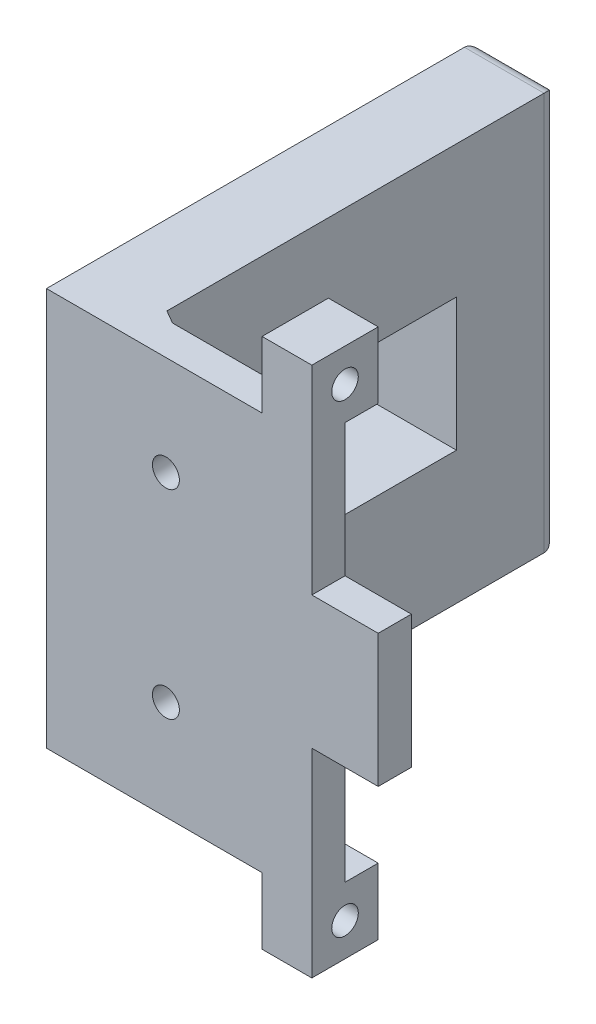
ISO-10303-21;
HEADER;
FILE_DESCRIPTION(('STEP AP214'),'2;1');
FILE_NAME('part.step','',(''),(''),'','','');
FILE_SCHEMA(('AUTOMOTIVE_DESIGN { 1 0 10303 214 1 1 1 1 }'));
ENDSEC;
DATA;
#1=APPLICATION_CONTEXT('core data for automotive mechanical design processes');
#2=APPLICATION_PROTOCOL_DEFINITION('international standard','automotive_design',2000,#1);
#3=PRODUCT_CONTEXT('',#1,'mechanical');
#4=PRODUCT('Part','Part','',(#3));
#5=PRODUCT_RELATED_PRODUCT_CATEGORY('part','',(#4));
#6=PRODUCT_DEFINITION_FORMATION('','',#4);
#7=PRODUCT_DEFINITION_CONTEXT('part definition',#1,'design');
#8=PRODUCT_DEFINITION('design','',#6,#7);
#9=PRODUCT_DEFINITION_SHAPE('','',#8);
#10=(LENGTH_UNIT() NAMED_UNIT(*) SI_UNIT(.MILLI.,.METRE.));
#11=(NAMED_UNIT(*) PLANE_ANGLE_UNIT() SI_UNIT($,.RADIAN.));
#12=(NAMED_UNIT(*) SI_UNIT($,.STERADIAN.) SOLID_ANGLE_UNIT());
#13=UNCERTAINTY_MEASURE_WITH_UNIT(LENGTH_MEASURE(1.E-05),#10,'distance_accuracy_value','');
#14=(GEOMETRIC_REPRESENTATION_CONTEXT(3) GLOBAL_UNCERTAINTY_ASSIGNED_CONTEXT((#13)) GLOBAL_UNIT_ASSIGNED_CONTEXT((#10,
#11,#12)) REPRESENTATION_CONTEXT('',''));
#15=CARTESIAN_POINT('',(0.,0.,0.));
#16=DIRECTION('',(0.,0.,1.));
#17=DIRECTION('',(1.,0.,0.));
#18=AXIS2_PLACEMENT_3D('',#15,#16,#17);
#19=CARTESIAN_POINT('',(-50.8000000000001,50.8000000000002,-76.21));
#20=DIRECTION('',(0.,-1.,0.));
#21=DIRECTION('',(1.,0.,0.));
#22=AXIS2_PLACEMENT_3D('',#19,#20,#21);
#23=PLANE('',#22);
#24=DIRECTION('',(-1.,0.,0.));
#25=VECTOR('',#24,1.);
#26=CARTESIAN_POINT('',(8.32667268468854E-13,50.7999999999994,0.));
#27=LINE('',#26,#25);
#28=CARTESIAN_POINT('',(-38.1000000000001,50.8,0.));
#29=VERTEX_POINT('',#28);
#30=CARTESIAN_POINT('',(-50.8000000000001,50.8000000000002,0.));
#31=VERTEX_POINT('',#30);
#32=EDGE_CURVE('E400',#29,#31,#27,.T.);
#33=ORIENTED_EDGE('',*,*,#32,.T.);
#34=DIRECTION('',(0.,0.,1.));
#35=VECTOR('',#34,1.);
#36=CARTESIAN_POINT('',(-50.8000000000001,50.8000000000002,-76.21));
#37=LINE('',#36,#35);
#38=CARTESIAN_POINT('',(-50.8000000000001,50.8000000000002,6.35));
#39=VERTEX_POINT('',#38);
#40=EDGE_CURVE('E11',#31,#39,#37,.T.);
#41=ORIENTED_EDGE('',*,*,#40,.T.);
#42=DIRECTION('',(-1.,0.,0.));
#43=VECTOR('',#42,1.);
#44=CARTESIAN_POINT('',(8.32667268468854E-13,50.7999999999994,6.35));
#45=LINE('',#44,#43);
#46=CARTESIAN_POINT('',(-38.1000000000001,50.8,6.35));
#47=VERTEX_POINT('',#46);
#48=EDGE_CURVE('E371',#47,#39,#45,.T.);
#49=ORIENTED_EDGE('',*,*,#48,.F.);
#50=DIRECTION('',(0.,0.,1.));
#51=VECTOR('',#50,1.);
#52=CARTESIAN_POINT('',(-38.1000000000001,50.8,-76.21));
#53=LINE('',#52,#51);
#54=EDGE_CURVE('E42',#29,#47,#53,.T.);
#55=ORIENTED_EDGE('',*,*,#54,.F.);
#56=EDGE_LOOP('',(#33,#41,#49,#55));
#57=FACE_BOUND('',#56,.T.);
#58=ADVANCED_FACE('F33',(#57),#23,.F.);
#59=CARTESIAN_POINT('',(-38.1000000000001,25.4,-76.21));
#60=DIRECTION('',(-1.,0.,0.));
#61=DIRECTION('',(0.,0.,1.));
#62=AXIS2_PLACEMENT_3D('',#59,#60,#61);
#63=PLANE('',#62);
#64=DIRECTION('',(0.,1.,0.));
#65=VECTOR('',#64,1.);
#66=CARTESIAN_POINT('',(-38.1000000000001,0.,0.));
#67=LINE('',#66,#65);
#68=CARTESIAN_POINT('',(-38.1000000000001,25.4,0.));
#69=VERTEX_POINT('',#68);
#70=EDGE_CURVE('E401',#69,#29,#67,.T.);
#71=ORIENTED_EDGE('',*,*,#70,.T.);
#72=ORIENTED_EDGE('',*,*,#54,.T.);
#73=DIRECTION('',(0.,1.,0.));
#74=VECTOR('',#73,1.);
#75=CARTESIAN_POINT('',(-38.1000000000001,0.,6.35));
#76=LINE('',#75,#74);
#77=CARTESIAN_POINT('',(-38.1000000000001,25.4,6.35));
#78=VERTEX_POINT('',#77);
#79=EDGE_CURVE('E374',#78,#47,#76,.T.);
#80=ORIENTED_EDGE('',*,*,#79,.F.);
#81=DIRECTION('',(0.,0.,1.));
#82=VECTOR('',#81,1.);
#83=CARTESIAN_POINT('',(-38.1000000000001,25.4,-76.21));
#84=LINE('',#83,#82);
#85=EDGE_CURVE('E386',#69,#78,#84,.T.);
#86=ORIENTED_EDGE('',*,*,#85,.F.);
#87=EDGE_LOOP('',(#71,#72,#80,#86));
#88=FACE_BOUND('',#87,.T.);
#89=ADVANCED_FACE('F416',(#88),#63,.F.);
#90=CARTESIAN_POINT('',(-50.8000000000001,25.4,-76.21));
#91=DIRECTION('',(0.,1.,0.));
#92=DIRECTION('',(0.,0.,1.));
#93=AXIS2_PLACEMENT_3D('',#90,#91,#92);
#94=PLANE('',#93);
#95=DIRECTION('',(1.,0.,0.));
#96=VECTOR('',#95,1.);
#97=CARTESIAN_POINT('',(0.,25.4,0.));
#98=LINE('',#97,#96);
#99=CARTESIAN_POINT('',(-50.8000000000001,25.4,0.));
#100=VERTEX_POINT('',#99);
#101=EDGE_CURVE('E37',#100,#69,#98,.T.);
#102=ORIENTED_EDGE('',*,*,#101,.T.);
#103=ORIENTED_EDGE('',*,*,#85,.T.);
#104=DIRECTION('',(1.,0.,0.));
#105=VECTOR('',#104,1.);
#106=CARTESIAN_POINT('',(0.,25.4,6.35));
#107=LINE('',#106,#105);
#108=CARTESIAN_POINT('',(-50.8000000000001,25.4,6.35));
#109=VERTEX_POINT('',#108);
#110=EDGE_CURVE('E377',#109,#78,#107,.T.);
#111=ORIENTED_EDGE('',*,*,#110,.F.);
#112=DIRECTION('',(0.,0.,1.));
#113=VECTOR('',#112,1.);
#114=CARTESIAN_POINT('',(-50.8000000000001,25.4,-76.21));
#115=LINE('',#114,#113);
#116=EDGE_CURVE('E360',#100,#109,#115,.T.);
#117=ORIENTED_EDGE('',*,*,#116,.F.);
#118=EDGE_LOOP('',(#102,#103,#111,#117));
#119=FACE_BOUND('',#118,.T.);
#120=ADVANCED_FACE('F408',(#119),#94,.F.);
#121=CARTESIAN_POINT('',(-50.8000000000001,-12.7,-76.21));
#122=DIRECTION('',(-1.,0.,0.));
#123=DIRECTION('',(0.,0.,1.));
#124=AXIS2_PLACEMENT_3D('',#121,#122,#123);
#125=PLANE('',#124);
#126=DIRECTION('',(0.,1.,0.));
#127=VECTOR('',#126,1.);
#128=CARTESIAN_POINT('',(-50.8000000000001,0.,0.));
#129=LINE('',#128,#127);
#130=CARTESIAN_POINT('',(-50.8000000000001,0.,0.));
#131=VERTEX_POINT('',#130);
#132=EDGE_CURVE('E382',#131,#100,#129,.T.);
#133=ORIENTED_EDGE('',*,*,#132,.T.);
#134=ORIENTED_EDGE('',*,*,#116,.T.);
#135=DIRECTION('',(0.,1.,0.));
#136=VECTOR('',#135,1.);
#137=CARTESIAN_POINT('',(-50.8000000000001,0.,6.35));
#138=LINE('',#137,#136);
#139=CARTESIAN_POINT('',(-50.8000000000001,-12.7,6.35));
#140=VERTEX_POINT('',#139);
#141=EDGE_CURVE('E380',#140,#109,#138,.T.);
#142=ORIENTED_EDGE('',*,*,#141,.F.);
#143=DIRECTION('',(0.,0.,-1.));
#144=VECTOR('',#143,1.);
#145=CARTESIAN_POINT('',(-50.8000000000001,-12.7,0.));
#146=LINE('',#145,#144);
#147=CARTESIAN_POINT('',(-50.8000000000001,-12.7,-6.34999999999999));
#148=VERTEX_POINT('',#147);
#149=EDGE_CURVE('E57',#140,#148,#146,.T.);
#150=ORIENTED_EDGE('',*,*,#149,.T.);
#151=DIRECTION('',(0.,1.,0.));
#152=VECTOR('',#151,1.);
#153=CARTESIAN_POINT('',(-50.8000000000001,-12.7,-6.34999999999999));
#154=LINE('',#153,#152);
#155=CARTESIAN_POINT('',(-50.8000000000001,0.,-6.34999999999999));
#156=VERTEX_POINT('',#155);
#157=EDGE_CURVE('E50',#148,#156,#154,.T.);
#158=ORIENTED_EDGE('',*,*,#157,.T.);
#159=DIRECTION('',(0.,0.,-1.));
#160=VECTOR('',#159,1.);
#161=CARTESIAN_POINT('',(-50.8000000000001,0.,0.));
#162=LINE('',#161,#160);
#163=EDGE_CURVE('E363',#131,#156,#162,.T.);
#164=ORIENTED_EDGE('',*,*,#163,.F.);
#165=EDGE_LOOP('',(#133,#134,#142,#150,#158,#164));
#166=FACE_BOUND('',#165,.T.);
#167=CARTESIAN_POINT('',(-50.8000000000001,-6.35000000000001,0.));
#168=DIRECTION('',(-1.,0.,0.));
#169=DIRECTION('',(0.,0.,1.));
#170=AXIS2_PLACEMENT_3D('',#167,#168,#169);
#171=CIRCLE('',#170,2.54);
#172=CARTESIAN_POINT('',(-50.8000000000001,-6.35000000000001,2.54));
#173=VERTEX_POINT('',#172);
#174=EDGE_CURVE('E357',#173,#173,#171,.T.);
#175=ORIENTED_EDGE('',*,*,#174,.T.);
#176=EDGE_LOOP('',(#175));
#177=FACE_BOUND('',#176,.T.);
#178=ADVANCED_FACE('F35',(#166,#177),#125,.F.);
#179=CARTESIAN_POINT('',(-50.8000000000003,88.9000000000002,-76.21));
#180=DIRECTION('',(-1.,0.,0.));
#181=DIRECTION('',(0.,-1.,0.));
#182=AXIS2_PLACEMENT_3D('',#179,#180,#181);
#183=PLANE('',#182);
#184=DIRECTION('',(0.,1.,0.));
#185=VECTOR('',#184,1.);
#186=CARTESIAN_POINT('',(-50.7999999999999,-2.40548322002117E-13,0.));
#187=LINE('',#186,#185);
#188=CARTESIAN_POINT('',(-50.8000000000003,76.2,0.));
#189=VERTEX_POINT('',#188);
#190=EDGE_CURVE('E368',#31,#189,#187,.T.);
#191=ORIENTED_EDGE('',*,*,#190,.T.);
#192=DIRECTION('',(0.,0.,1.));
#193=VECTOR('',#192,1.);
#194=CARTESIAN_POINT('',(-50.8000000000003,76.2,0.));
#195=LINE('',#194,#193);
#196=CARTESIAN_POINT('',(-50.8000000000003,76.2,-6.34999999999999));
#197=VERTEX_POINT('',#196);
#198=EDGE_CURVE('E392',#197,#189,#195,.T.);
#199=ORIENTED_EDGE('',*,*,#198,.F.);
#200=DIRECTION('',(0.,-1.,0.));
#201=VECTOR('',#200,1.);
#202=CARTESIAN_POINT('',(-50.8000000000003,88.9,-6.34999999999999));
#203=LINE('',#202,#201);
#204=CARTESIAN_POINT('',(-50.8000000000003,88.9,-6.34999999999999));
#205=VERTEX_POINT('',#204);
#206=EDGE_CURVE('E372',#205,#197,#203,.T.);
#207=ORIENTED_EDGE('',*,*,#206,.F.);
#208=DIRECTION('',(0.,0.,1.));
#209=VECTOR('',#208,1.);
#210=CARTESIAN_POINT('',(-50.8000000000003,88.9,0.));
#211=LINE('',#210,#209);
#212=CARTESIAN_POINT('',(-50.8000000000003,88.9,6.35));
#213=VERTEX_POINT('',#212);
#214=EDGE_CURVE('E365',#205,#213,#211,.T.);
#215=ORIENTED_EDGE('',*,*,#214,.T.);
#216=DIRECTION('',(0.,1.,0.));
#217=VECTOR('',#216,1.);
#218=CARTESIAN_POINT('',(-50.7999999999999,-2.40548322002117E-13,6.35));
#219=LINE('',#218,#217);
#220=EDGE_CURVE('E369',#39,#213,#219,.T.);
#221=ORIENTED_EDGE('',*,*,#220,.F.);
#222=ORIENTED_EDGE('',*,*,#40,.F.);
#223=EDGE_LOOP('',(#191,#199,#207,#215,#221,#222));
#224=FACE_BOUND('',#223,.T.);
#225=CARTESIAN_POINT('',(-50.8000000000003,82.55,0.));
#226=DIRECTION('',(-1.,0.,0.));
#227=DIRECTION('',(0.,-1.,0.));
#228=AXIS2_PLACEMENT_3D('',#225,#226,#227);
#229=CIRCLE('',#228,2.54);
#230=CARTESIAN_POINT('',(-50.8000000000003,80.01,0.));
#231=VERTEX_POINT('',#230);
#232=EDGE_CURVE('E348',#231,#231,#229,.F.);
#233=ORIENTED_EDGE('',*,*,#232,.F.);
#234=EDGE_LOOP('',(#233));
#235=FACE_BOUND('',#234,.T.);
#236=ADVANCED_FACE('F457',(#224,#235),#183,.F.);
#237=CARTESIAN_POINT('',(-101.6,0.,6.35));
#238=DIRECTION('',(0.,1.,0.));
#239=DIRECTION('',(0.,0.,1.));
#240=AXIS2_PLACEMENT_3D('',#237,#238,#239);
#241=PLANE('',#240);
#242=DIRECTION('',(1.,0.,0.));
#243=VECTOR('',#242,1.);
#244=CARTESIAN_POINT('',(-101.6,0.,0.));
#245=LINE('',#244,#243);
#246=CARTESIAN_POINT('',(-83.8200000000001,0.,0.));
#247=VERTEX_POINT('',#246);
#248=CARTESIAN_POINT('',(-60.325,0.,0.));
#249=VERTEX_POINT('',#248);
#250=EDGE_CURVE('E301',#247,#249,#245,.T.);
#251=ORIENTED_EDGE('',*,*,#250,.T.);
#252=DIRECTION('',(0.,0.,1.));
#253=VECTOR('',#252,1.);
#254=CARTESIAN_POINT('',(-60.325,0.,6.35));
#255=LINE('',#254,#253);
#256=CARTESIAN_POINT('',(-60.325,0.,6.35));
#257=VERTEX_POINT('',#256);
#258=EDGE_CURVE('E224',#249,#257,#255,.T.);
#259=ORIENTED_EDGE('',*,*,#258,.T.);
#260=DIRECTION('',(1.,0.,0.));
#261=VECTOR('',#260,1.);
#262=CARTESIAN_POINT('',(-101.6,0.,6.35));
#263=LINE('',#262,#261);
#264=CARTESIAN_POINT('',(-101.6,0.,6.35));
#265=VERTEX_POINT('',#264);
#266=EDGE_CURVE('E302',#265,#257,#263,.T.);
#267=ORIENTED_EDGE('',*,*,#266,.F.);
#268=DIRECTION('',(0.,0.,-1.));
#269=VECTOR('',#268,1.);
#270=CARTESIAN_POINT('',(-101.6,0.,6.35));
#271=LINE('',#270,#269);
#272=CARTESIAN_POINT('',(-101.6,0.,-73.66));
#273=VERTEX_POINT('',#272);
#274=EDGE_CURVE('E310',#265,#273,#271,.T.);
#275=ORIENTED_EDGE('',*,*,#274,.T.);
#276=DIRECTION('',(-1.,0.,0.));
#277=VECTOR('',#276,1.);
#278=CARTESIAN_POINT('',(-86.3600000000001,0.,-73.66));
#279=LINE('',#278,#277);
#280=CARTESIAN_POINT('',(-86.3600000000001,0.,-73.66));
#281=VERTEX_POINT('',#280);
#282=EDGE_CURVE('E339',#273,#281,#279,.F.);
#283=ORIENTED_EDGE('',*,*,#282,.T.);
#284=DIRECTION('',(0.,0.,1.));
#285=VECTOR('',#284,1.);
#286=CARTESIAN_POINT('',(-86.3600000000001,0.,-76.2));
#287=LINE('',#286,#285);
#288=CARTESIAN_POINT('',(-86.3600000000001,0.,-1.4664696837417));
#289=VERTEX_POINT('',#288);
#290=EDGE_CURVE('E284',#281,#289,#287,.T.);
#291=ORIENTED_EDGE('',*,*,#290,.T.);
#292=DIRECTION('',(0.866025403784437,0.,0.500000000000004));
#293=VECTOR('',#292,1.);
#294=CARTESIAN_POINT('',(-94.4053693429845,0.,-6.11146583964369));
#295=LINE('',#294,#293);
#296=EDGE_CURVE('E325',#289,#247,#295,.T.);
#297=ORIENTED_EDGE('',*,*,#296,.T.);
#298=EDGE_LOOP('',(#251,#259,#267,#275,#283,#291,#297));
#299=FACE_BOUND('',#298,.T.);
#300=ADVANCED_FACE('F466',(#299),#241,.F.);
#301=CARTESIAN_POINT('',(-101.6,76.2,6.35));
#302=DIRECTION('',(0.,1.,0.));
#303=DIRECTION('',(-1.,0.,0.));
#304=AXIS2_PLACEMENT_3D('',#301,#302,#303);
#305=PLANE('',#304);
#306=DIRECTION('',(1.,0.,0.));
#307=VECTOR('',#306,1.);
#308=CARTESIAN_POINT('',(-101.6,76.2,6.35));
#309=LINE('',#308,#307);
#310=CARTESIAN_POINT('',(-101.6,76.2,6.35));
#311=VERTEX_POINT('',#310);
#312=CARTESIAN_POINT('',(-60.325,76.2,6.35));
#313=VERTEX_POINT('',#312);
#314=EDGE_CURVE('E305',#311,#313,#309,.T.);
#315=ORIENTED_EDGE('',*,*,#314,.T.);
#316=DIRECTION('',(0.,0.,1.));
#317=VECTOR('',#316,1.);
#318=CARTESIAN_POINT('',(-60.325,76.2,6.35));
#319=LINE('',#318,#317);
#320=CARTESIAN_POINT('',(-60.325,76.2,0.));
#321=VERTEX_POINT('',#320);
#322=EDGE_CURVE('E228',#321,#313,#319,.T.);
#323=ORIENTED_EDGE('',*,*,#322,.F.);
#324=DIRECTION('',(1.,0.,0.));
#325=VECTOR('',#324,1.);
#326=CARTESIAN_POINT('',(-101.6,76.2,0.));
#327=LINE('',#326,#325);
#328=CARTESIAN_POINT('',(-83.8200000000001,76.2,0.));
#329=VERTEX_POINT('',#328);
#330=EDGE_CURVE('E306',#329,#321,#327,.T.);
#331=ORIENTED_EDGE('',*,*,#330,.F.);
#332=DIRECTION('',(-0.866025403784437,0.,-0.500000000000004));
#333=VECTOR('',#332,1.);
#334=CARTESIAN_POINT('',(-86.3600000000001,76.2,-1.46646968374167));
#335=LINE('',#334,#333);
#336=CARTESIAN_POINT('',(-86.3600000000001,76.2,-1.4664696837417));
#337=VERTEX_POINT('',#336);
#338=EDGE_CURVE('E327',#329,#337,#335,.T.);
#339=ORIENTED_EDGE('',*,*,#338,.T.);
#340=DIRECTION('',(0.,0.,1.));
#341=VECTOR('',#340,1.);
#342=CARTESIAN_POINT('',(-86.3600000000001,76.2,-76.2));
#343=LINE('',#342,#341);
#344=CARTESIAN_POINT('',(-86.3600000000001,76.2,-73.66));
#345=VERTEX_POINT('',#344);
#346=EDGE_CURVE('E286',#345,#337,#343,.T.);
#347=ORIENTED_EDGE('',*,*,#346,.F.);
#348=DIRECTION('',(1.,0.,0.));
#349=VECTOR('',#348,1.);
#350=CARTESIAN_POINT('',(-101.6,76.2,-73.66));
#351=LINE('',#350,#349);
#352=CARTESIAN_POINT('',(-101.6,76.2,-73.66));
#353=VERTEX_POINT('',#352);
#354=EDGE_CURVE('E346',#345,#353,#351,.F.);
#355=ORIENTED_EDGE('',*,*,#354,.T.);
#356=DIRECTION('',(0.,0.,-1.));
#357=VECTOR('',#356,1.);
#358=CARTESIAN_POINT('',(-101.6,76.2,6.35));
#359=LINE('',#358,#357);
#360=EDGE_CURVE('E317',#311,#353,#359,.T.);
#361=ORIENTED_EDGE('',*,*,#360,.F.);
#362=EDGE_LOOP('',(#315,#323,#331,#339,#347,#355,#361));
#363=FACE_BOUND('',#362,.T.);
#364=ADVANCED_FACE('F471',(#363),#305,.T.);
#365=CARTESIAN_POINT('',(-101.6,76.2,6.35));
#366=DIRECTION('',(1.,0.,0.));
#367=DIRECTION('',(0.,1.,0.));
#368=AXIS2_PLACEMENT_3D('',#365,#366,#367);
#369=PLANE('',#368);
#370=ORIENTED_EDGE('',*,*,#360,.T.);
#371=DIRECTION('',(0.,1.,0.));
#372=VECTOR('',#371,1.);
#373=CARTESIAN_POINT('',(-101.6,0.,-73.66));
#374=LINE('',#373,#372);
#375=EDGE_CURVE('E344',#353,#273,#374,.F.);
#376=ORIENTED_EDGE('',*,*,#375,.T.);
#377=ORIENTED_EDGE('',*,*,#274,.F.);
#378=DIRECTION('',(0.,-1.,0.));
#379=VECTOR('',#378,1.);
#380=CARTESIAN_POINT('',(-101.6,76.2,6.35));
#381=LINE('',#380,#379);
#382=EDGE_CURVE('E308',#311,#265,#381,.T.);
#383=ORIENTED_EDGE('',*,*,#382,.F.);
#384=EDGE_LOOP('',(#370,#376,#377,#383));
#385=FACE_BOUND('',#384,.T.);
#386=DIRECTION('',(0.,0.,-1.));
#387=VECTOR('',#386,1.);
#388=CARTESIAN_POINT('',(-101.6,25.4,-16.764));
#389=LINE('',#388,#387);
#390=CARTESIAN_POINT('',(-101.6,25.4,-16.764));
#391=VERTEX_POINT('',#390);
#392=CARTESIAN_POINT('',(-101.6,25.4,-56.896));
#393=VERTEX_POINT('',#392);
#394=EDGE_CURVE('E259',#391,#393,#389,.T.);
#395=ORIENTED_EDGE('',*,*,#394,.T.);
#396=DIRECTION('',(0.,-1.,0.));
#397=VECTOR('',#396,1.);
#398=CARTESIAN_POINT('',(-101.6,50.8,-56.896));
#399=LINE('',#398,#397);
#400=CARTESIAN_POINT('',(-101.6,50.8,-56.896));
#401=VERTEX_POINT('',#400);
#402=EDGE_CURVE('E270',#401,#393,#399,.T.);
#403=ORIENTED_EDGE('',*,*,#402,.F.);
#404=DIRECTION('',(0.,0.,-1.));
#405=VECTOR('',#404,1.);
#406=CARTESIAN_POINT('',(-101.6,50.8,-16.764));
#407=LINE('',#406,#405);
#408=CARTESIAN_POINT('',(-101.6,50.8,-16.764));
#409=VERTEX_POINT('',#408);
#410=EDGE_CURVE('E267',#409,#401,#407,.T.);
#411=ORIENTED_EDGE('',*,*,#410,.F.);
#412=DIRECTION('',(0.,-1.,0.));
#413=VECTOR('',#412,1.);
#414=CARTESIAN_POINT('',(-101.6,50.8,-16.764));
#415=LINE('',#414,#413);
#416=EDGE_CURVE('E264',#409,#391,#415,.T.);
#417=ORIENTED_EDGE('',*,*,#416,.T.);
#418=EDGE_LOOP('',(#395,#403,#411,#417));
#419=FACE_BOUND('',#418,.T.);
#420=ADVANCED_FACE('F734',(#385,#419),#369,.F.);
#421=CARTESIAN_POINT('',(-86.3600000000001,76.2,-76.2));
#422=DIRECTION('',(-1.,0.,0.));
#423=DIRECTION('',(0.,0.,1.));
#424=AXIS2_PLACEMENT_3D('',#421,#422,#423);
#425=PLANE('',#424);
#426=ORIENTED_EDGE('',*,*,#290,.F.);
#427=DIRECTION('',(0.,-1.,0.));
#428=VECTOR('',#427,1.);
#429=CARTESIAN_POINT('',(-86.3600000000001,76.2,-73.66));
#430=LINE('',#429,#428);
#431=EDGE_CURVE('E342',#281,#345,#430,.F.);
#432=ORIENTED_EDGE('',*,*,#431,.T.);
#433=ORIENTED_EDGE('',*,*,#346,.T.);
#434=DIRECTION('',(0.,-1.,0.));
#435=VECTOR('',#434,1.);
#436=CARTESIAN_POINT('',(-86.3600000000001,76.2,-1.46646968374167));
#437=LINE('',#436,#435);
#438=EDGE_CURVE('E320',#337,#289,#437,.T.);
#439=ORIENTED_EDGE('',*,*,#438,.T.);
#440=EDGE_LOOP('',(#426,#432,#433,#439));
#441=FACE_BOUND('',#440,.T.);
#442=DIRECTION('',(0.,0.,1.));
#443=VECTOR('',#442,1.);
#444=CARTESIAN_POINT('',(-86.3600000000001,25.4,-16.764));
#445=LINE('',#444,#443);
#446=CARTESIAN_POINT('',(-86.3600000000001,25.3999999999998,-56.896));
#447=VERTEX_POINT('',#446);
#448=CARTESIAN_POINT('',(-86.3600000000001,25.3999999999998,-16.764));
#449=VERTEX_POINT('',#448);
#450=EDGE_CURVE('E251',#447,#449,#445,.T.);
#451=ORIENTED_EDGE('',*,*,#450,.T.);
#452=DIRECTION('',(0.,1.,0.));
#453=VECTOR('',#452,1.);
#454=CARTESIAN_POINT('',(-86.3600000000001,50.7999999999998,-16.764));
#455=LINE('',#454,#453);
#456=CARTESIAN_POINT('',(-86.3600000000001,50.8,-16.764));
#457=VERTEX_POINT('',#456);
#458=EDGE_CURVE('E252',#449,#457,#455,.T.);
#459=ORIENTED_EDGE('',*,*,#458,.T.);
#460=DIRECTION('',(0.,0.,1.));
#461=VECTOR('',#460,1.);
#462=CARTESIAN_POINT('',(-86.3600000000001,50.8,-16.764));
#463=LINE('',#462,#461);
#464=CARTESIAN_POINT('',(-86.3600000000001,50.8,-56.896));
#465=VERTEX_POINT('',#464);
#466=EDGE_CURVE('E279',#465,#457,#463,.T.);
#467=ORIENTED_EDGE('',*,*,#466,.F.);
#468=DIRECTION('',(0.,1.,0.));
#469=VECTOR('',#468,1.);
#470=CARTESIAN_POINT('',(-86.3600000000001,50.7999999999998,-56.896));
#471=LINE('',#470,#469);
#472=EDGE_CURVE('E273',#447,#465,#471,.T.);
#473=ORIENTED_EDGE('',*,*,#472,.F.);
#474=EDGE_LOOP('',(#451,#459,#467,#473));
#475=FACE_BOUND('',#474,.T.);
#476=ADVANCED_FACE('F689',(#441,#475),#425,.F.);
#477=CARTESIAN_POINT('',(0.,0.,0.));
#478=DIRECTION('',(0.,0.,-1.));
#479=DIRECTION('',(-1.,0.,0.));
#480=AXIS2_PLACEMENT_3D('',#477,#478,#479);
#481=PLANE('',#480);
#482=ORIENTED_EDGE('',*,*,#132,.F.);
#483=DIRECTION('',(-1.,0.,0.));
#484=VECTOR('',#483,1.);
#485=CARTESIAN_POINT('',(0.,0.,0.));
#486=LINE('',#485,#484);
#487=EDGE_CURVE('E211',#131,#249,#486,.T.);
#488=ORIENTED_EDGE('',*,*,#487,.T.);
#489=ORIENTED_EDGE('',*,*,#250,.F.);
#490=DIRECTION('',(0.,1.,0.));
#491=VECTOR('',#490,1.);
#492=CARTESIAN_POINT('',(-83.8200000000001,0.,0.));
#493=LINE('',#492,#491);
#494=EDGE_CURVE('E323',#247,#329,#493,.T.);
#495=ORIENTED_EDGE('',*,*,#494,.T.);
#496=ORIENTED_EDGE('',*,*,#330,.T.);
#497=DIRECTION('',(1.,0.,0.));
#498=VECTOR('',#497,1.);
#499=CARTESIAN_POINT('',(0.,76.2,0.));
#500=LINE('',#499,#498);
#501=EDGE_CURVE('E248',#321,#189,#500,.T.);
#502=ORIENTED_EDGE('',*,*,#501,.T.);
#503=ORIENTED_EDGE('',*,*,#190,.F.);
#504=ORIENTED_EDGE('',*,*,#32,.F.);
#505=ORIENTED_EDGE('',*,*,#70,.F.);
#506=ORIENTED_EDGE('',*,*,#101,.F.);
#507=EDGE_LOOP('',(#482,#488,#489,#495,#496,#502,#503,#504,#505,#506));
#508=FACE_BOUND('',#507,.T.);
#509=CARTESIAN_POINT('',(-78.74,57.15,0.));
#510=DIRECTION('',(0.,0.,1.));
#511=DIRECTION('',(1.,0.,0.));
#512=AXIS2_PLACEMENT_3D('',#509,#510,#511);
#513=CIRCLE('',#512,2.57975099999999);
#514=CARTESIAN_POINT('',(-76.160249,57.15,0.));
#515=VERTEX_POINT('',#514);
#516=EDGE_CURVE('E292',#515,#515,#513,.T.);
#517=ORIENTED_EDGE('',*,*,#516,.T.);
#518=EDGE_LOOP('',(#517));
#519=FACE_BOUND('',#518,.T.);
#520=CARTESIAN_POINT('',(-78.74,19.05,0.));
#521=DIRECTION('',(0.,0.,1.));
#522=DIRECTION('',(1.,0.,0.));
#523=AXIS2_PLACEMENT_3D('',#520,#521,#522);
#524=CIRCLE('',#523,2.57975099999999);
#525=CARTESIAN_POINT('',(-76.160249,19.05,0.));
#526=VERTEX_POINT('',#525);
#527=EDGE_CURVE('E298',#526,#526,#524,.T.);
#528=ORIENTED_EDGE('',*,*,#527,.T.);
#529=EDGE_LOOP('',(#528));
#530=FACE_BOUND('',#529,.T.);
#531=ADVANCED_FACE('F411',(#508,#519,#530),#481,.T.);
#532=CARTESIAN_POINT('',(0.,0.,6.35));
#533=DIRECTION('',(0.,0.,-1.));
#534=DIRECTION('',(-1.,0.,0.));
#535=AXIS2_PLACEMENT_3D('',#532,#533,#534);
#536=PLANE('',#535);
#537=CARTESIAN_POINT('',(-78.74,57.15,6.35));
#538=DIRECTION('',(0.,0.,1.));
#539=DIRECTION('',(1.,0.,0.));
#540=AXIS2_PLACEMENT_3D('',#537,#538,#539);
#541=CIRCLE('',#540,2.57975100000001);
#542=CARTESIAN_POINT('',(-76.160249,57.15,6.35));
#543=VERTEX_POINT('',#542);
#544=EDGE_CURVE('E289',#543,#543,#541,.T.);
#545=ORIENTED_EDGE('',*,*,#544,.F.);
#546=EDGE_LOOP('',(#545));
#547=FACE_BOUND('',#546,.T.);
#548=CARTESIAN_POINT('',(-78.74,19.05,6.35));
#549=DIRECTION('',(0.,0.,1.));
#550=DIRECTION('',(1.,0.,0.));
#551=AXIS2_PLACEMENT_3D('',#548,#549,#550);
#552=CIRCLE('',#551,2.57975100000001);
#553=CARTESIAN_POINT('',(-76.160249,19.05,6.35));
#554=VERTEX_POINT('',#553);
#555=EDGE_CURVE('E295',#554,#554,#552,.T.);
#556=ORIENTED_EDGE('',*,*,#555,.F.);
#557=EDGE_LOOP('',(#556));
#558=FACE_BOUND('',#557,.T.);
#559=DIRECTION('',(1.,0.,0.));
#560=VECTOR('',#559,1.);
#561=CARTESIAN_POINT('',(-41.275,-12.7,6.35));
#562=LINE('',#561,#560);
#563=CARTESIAN_POINT('',(-60.325,-12.7,6.35));
#564=VERTEX_POINT('',#563);
#565=EDGE_CURVE('E202',#564,#140,#562,.T.);
#566=ORIENTED_EDGE('',*,*,#565,.T.);
#567=ORIENTED_EDGE('',*,*,#141,.T.);
#568=ORIENTED_EDGE('',*,*,#110,.T.);
#569=ORIENTED_EDGE('',*,*,#79,.T.);
#570=ORIENTED_EDGE('',*,*,#48,.T.);
#571=ORIENTED_EDGE('',*,*,#220,.T.);
#572=DIRECTION('',(1.,0.,0.));
#573=VECTOR('',#572,1.);
#574=CARTESIAN_POINT('',(-41.275,88.9,6.35));
#575=LINE('',#574,#573);
#576=CARTESIAN_POINT('',(-60.325,88.9,6.35));
#577=VERTEX_POINT('',#576);
#578=EDGE_CURVE('E232',#577,#213,#575,.T.);
#579=ORIENTED_EDGE('',*,*,#578,.F.);
#580=DIRECTION('',(0.,-1.,0.));
#581=VECTOR('',#580,1.);
#582=CARTESIAN_POINT('',(-60.325,88.9,6.35));
#583=LINE('',#582,#581);
#584=EDGE_CURVE('E245',#577,#313,#583,.T.);
#585=ORIENTED_EDGE('',*,*,#584,.T.);
#586=ORIENTED_EDGE('',*,*,#314,.F.);
#587=ORIENTED_EDGE('',*,*,#382,.T.);
#588=ORIENTED_EDGE('',*,*,#266,.T.);
#589=DIRECTION('',(0.,1.,0.));
#590=VECTOR('',#589,1.);
#591=CARTESIAN_POINT('',(-60.325,-12.7,6.35));
#592=LINE('',#591,#590);
#593=EDGE_CURVE('E212',#564,#257,#592,.T.);
#594=ORIENTED_EDGE('',*,*,#593,.F.);
#595=EDGE_LOOP('',(#566,#567,#568,#569,#570,#571,#579,#585,#586,#587,#588,#594));
#596=FACE_BOUND('',#595,.T.);
#597=ADVANCED_FACE('F418',(#547,#558,#596),#536,.F.);
#598=CARTESIAN_POINT('',(-78.74,19.05,6.35));
#599=DIRECTION('',(0.,0.,1.));
#600=DIRECTION('',(1.,0.,0.));
#601=AXIS2_PLACEMENT_3D('',#598,#599,#600);
#602=CYLINDRICAL_SURFACE('',#601,2.579751);
#603=ORIENTED_EDGE('',*,*,#527,.F.);
#604=EDGE_LOOP('',(#603));
#605=FACE_BOUND('',#604,.T.);
#606=ORIENTED_EDGE('',*,*,#555,.T.);
#607=EDGE_LOOP('',(#606));
#608=FACE_BOUND('',#607,.T.);
#609=ADVANCED_FACE('F659',(#605,#608),#602,.F.);
#610=CARTESIAN_POINT('',(-78.74,57.15,6.35));
#611=DIRECTION('',(0.,0.,1.));
#612=DIRECTION('',(1.,0.,0.));
#613=AXIS2_PLACEMENT_3D('',#610,#611,#612);
#614=CYLINDRICAL_SURFACE('',#613,2.579751);
#615=ORIENTED_EDGE('',*,*,#516,.F.);
#616=EDGE_LOOP('',(#615));
#617=FACE_BOUND('',#616,.T.);
#618=ORIENTED_EDGE('',*,*,#544,.T.);
#619=EDGE_LOOP('',(#618));
#620=FACE_BOUND('',#619,.T.);
#621=ADVANCED_FACE('F649',(#617,#620),#614,.F.);
#622=CARTESIAN_POINT('',(0.,0.,-76.2));
#623=DIRECTION('',(0.,0.,-1.));
#624=DIRECTION('',(-1.,0.,0.));
#625=AXIS2_PLACEMENT_3D('',#622,#623,#624);
#626=PLANE('',#625);
#627=DIRECTION('',(0.,-1.,0.));
#628=VECTOR('',#627,1.);
#629=CARTESIAN_POINT('',(-88.9000000000001,0.,-76.2));
#630=LINE('',#629,#628);
#631=CARTESIAN_POINT('',(-88.9000000000001,73.66,-76.2));
#632=VERTEX_POINT('',#631);
#633=CARTESIAN_POINT('',(-88.9000000000001,2.54,-76.2));
#634=VERTEX_POINT('',#633);
#635=EDGE_CURVE('E334',#632,#634,#630,.T.);
#636=ORIENTED_EDGE('',*,*,#635,.T.);
#637=DIRECTION('',(-1.,0.,0.));
#638=VECTOR('',#637,1.);
#639=CARTESIAN_POINT('',(-101.6,2.54,-76.2));
#640=LINE('',#639,#638);
#641=CARTESIAN_POINT('',(-99.0600000000001,2.54,-76.2));
#642=VERTEX_POINT('',#641);
#643=EDGE_CURVE('E336',#634,#642,#640,.T.);
#644=ORIENTED_EDGE('',*,*,#643,.T.);
#645=DIRECTION('',(0.,1.,0.));
#646=VECTOR('',#645,1.);
#647=CARTESIAN_POINT('',(-99.06,76.2,-76.2));
#648=LINE('',#647,#646);
#649=CARTESIAN_POINT('',(-99.06,73.66,-76.2));
#650=VERTEX_POINT('',#649);
#651=EDGE_CURVE('E332',#642,#650,#648,.T.);
#652=ORIENTED_EDGE('',*,*,#651,.T.);
#653=DIRECTION('',(1.,0.,0.));
#654=VECTOR('',#653,1.);
#655=CARTESIAN_POINT('',(0.,73.66,-76.2));
#656=LINE('',#655,#654);
#657=EDGE_CURVE('E330',#650,#632,#656,.T.);
#658=ORIENTED_EDGE('',*,*,#657,.T.);
#659=EDGE_LOOP('',(#636,#644,#652,#658));
#660=FACE_BOUND('',#659,.T.);
#661=ADVANCED_FACE('F639',(#660),#626,.T.);
#662=CARTESIAN_POINT('',(-86.3600000000001,76.2,-1.46646968374167));
#663=DIRECTION('',(-0.500000000000004,0.,0.866025403784437));
#664=DIRECTION('',(0.,-1.,0.));
#665=AXIS2_PLACEMENT_3D('',#662,#663,#664);
#666=PLANE('',#665);
#667=ORIENTED_EDGE('',*,*,#338,.F.);
#668=ORIENTED_EDGE('',*,*,#494,.F.);
#669=ORIENTED_EDGE('',*,*,#296,.F.);
#670=ORIENTED_EDGE('',*,*,#438,.F.);
#671=EDGE_LOOP('',(#667,#668,#669,#670));
#672=FACE_BOUND('',#671,.T.);
#673=ADVANCED_FACE('F631',(#672),#666,.F.);
#674=CARTESIAN_POINT('',(0.,73.66,-73.66));
#675=DIRECTION('',(1.,0.,0.));
#676=DIRECTION('',(0.,1.,0.));
#677=AXIS2_PLACEMENT_3D('',#674,#675,#676);
#678=CYLINDRICAL_SURFACE('',#677,2.54);
#679=CARTESIAN_POINT('',(-99.06,73.66,-73.66));
#680=DIRECTION('',(0.707106781186548,0.707106781186547,0.));
#681=DIRECTION('',(0.707106781186547,-0.707106781186548,0.));
#682=AXIS2_PLACEMENT_3D('',#679,#680,#681);
#683=ELLIPSE('',#682,3.59210244842766,2.54);
#684=EDGE_CURVE('E352',#353,#650,#683,.F.);
#685=ORIENTED_EDGE('',*,*,#684,.F.);
#686=ORIENTED_EDGE('',*,*,#354,.F.);
#687=CARTESIAN_POINT('',(-88.9000000000001,73.66,-73.66));
#688=DIRECTION('',(0.707106781186548,-0.707106781186547,0.));
#689=DIRECTION('',(0.707106781186547,0.707106781186548,0.));
#690=AXIS2_PLACEMENT_3D('',#687,#688,#689);
#691=ELLIPSE('',#690,3.59210244842766,2.54);
#692=EDGE_CURVE('E287',#632,#345,#691,.T.);
#693=ORIENTED_EDGE('',*,*,#692,.F.);
#694=ORIENTED_EDGE('',*,*,#657,.F.);
#695=EDGE_LOOP('',(#685,#686,#693,#694));
#696=FACE_BOUND('',#695,.T.);
#697=ADVANCED_FACE('F622',(#696),#678,.T.);
#698=CARTESIAN_POINT('',(-88.9000000000001,0.,-73.66));
#699=DIRECTION('',(0.,1.,0.));
#700=DIRECTION('',(0.,0.,1.));
#701=AXIS2_PLACEMENT_3D('',#698,#699,#700);
#702=CYLINDRICAL_SURFACE('',#701,2.54);
#703=ORIENTED_EDGE('',*,*,#692,.T.);
#704=ORIENTED_EDGE('',*,*,#431,.F.);
#705=CARTESIAN_POINT('',(-88.9000000000001,2.54,-73.66));
#706=DIRECTION('',(0.707106781186547,0.707106781186547,0.));
#707=DIRECTION('',(-0.707106781186547,0.707106781186547,0.));
#708=AXIS2_PLACEMENT_3D('',#705,#706,#707);
#709=ELLIPSE('',#708,3.59210244842766,2.54);
#710=EDGE_CURVE('E350',#634,#281,#709,.F.);
#711=ORIENTED_EDGE('',*,*,#710,.F.);
#712=ORIENTED_EDGE('',*,*,#635,.F.);
#713=EDGE_LOOP('',(#703,#704,#711,#712));
#714=FACE_BOUND('',#713,.T.);
#715=ADVANCED_FACE('F612',(#714),#702,.T.);
#716=CARTESIAN_POINT('',(-99.0600000000001,1.98452365651747E-13,-73.66));
#717=DIRECTION('',(0.,-1.,0.));
#718=DIRECTION('',(1.,0.,0.));
#719=AXIS2_PLACEMENT_3D('',#716,#717,#718);
#720=CYLINDRICAL_SURFACE('',#719,2.54);
#721=ORIENTED_EDGE('',*,*,#684,.T.);
#722=ORIENTED_EDGE('',*,*,#651,.F.);
#723=CARTESIAN_POINT('',(-99.0600000000001,2.54,-73.66));
#724=DIRECTION('',(0.707106781186547,-0.707106781186548,0.));
#725=DIRECTION('',(-0.707106781186548,-0.707106781186547,0.));
#726=AXIS2_PLACEMENT_3D('',#723,#724,#725);
#727=ELLIPSE('',#726,3.59210244842767,2.54);
#728=EDGE_CURVE('E282',#273,#642,#727,.T.);
#729=ORIENTED_EDGE('',*,*,#728,.F.);
#730=ORIENTED_EDGE('',*,*,#375,.F.);
#731=EDGE_LOOP('',(#721,#722,#729,#730));
#732=FACE_BOUND('',#731,.T.);
#733=ADVANCED_FACE('F601',(#732),#720,.T.);
#734=CARTESIAN_POINT('',(0.,2.54,-73.66));
#735=DIRECTION('',(1.,0.,0.));
#736=DIRECTION('',(0.,0.,-1.));
#737=AXIS2_PLACEMENT_3D('',#734,#735,#736);
#738=CYLINDRICAL_SURFACE('',#737,2.54);
#739=ORIENTED_EDGE('',*,*,#710,.T.);
#740=ORIENTED_EDGE('',*,*,#282,.F.);
#741=ORIENTED_EDGE('',*,*,#728,.T.);
#742=ORIENTED_EDGE('',*,*,#643,.F.);
#743=EDGE_LOOP('',(#739,#740,#741,#742));
#744=FACE_BOUND('',#743,.T.);
#745=ADVANCED_FACE('F591',(#744),#738,.T.);
#746=CARTESIAN_POINT('',(0.00100000000005651,25.3999999999998,-16.764));
#747=DIRECTION('',(0.,1.,0.));
#748=DIRECTION('',(-1.,0.,0.));
#749=AXIS2_PLACEMENT_3D('',#746,#747,#748);
#750=PLANE('',#749);
#751=DIRECTION('',(-1.,0.,0.));
#752=VECTOR('',#751,1.);
#753=CARTESIAN_POINT('',(0.00100000000005651,25.3999999999998,-56.896));
#754=LINE('',#753,#752);
#755=EDGE_CURVE('E257',#447,#393,#754,.T.);
#756=ORIENTED_EDGE('',*,*,#755,.T.);
#757=ORIENTED_EDGE('',*,*,#394,.F.);
#758=DIRECTION('',(-1.,0.,0.));
#759=VECTOR('',#758,1.);
#760=CARTESIAN_POINT('',(0.00100000000005651,25.3999999999998,-16.764));
#761=LINE('',#760,#759);
#762=EDGE_CURVE('E261',#449,#391,#761,.T.);
#763=ORIENTED_EDGE('',*,*,#762,.F.);
#764=ORIENTED_EDGE('',*,*,#450,.F.);
#765=EDGE_LOOP('',(#756,#757,#763,#764));
#766=FACE_BOUND('',#765,.T.);
#767=ADVANCED_FACE('F582',(#766),#750,.T.);
#768=CARTESIAN_POINT('',(0.00100000000009814,50.7999999999998,-56.896));
#769=DIRECTION('',(0.,0.,-1.));
#770=DIRECTION('',(-1.,0.,0.));
#771=AXIS2_PLACEMENT_3D('',#768,#769,#770);
#772=PLANE('',#771);
#773=ORIENTED_EDGE('',*,*,#472,.T.);
#774=DIRECTION('',(-1.,0.,0.));
#775=VECTOR('',#774,1.);
#776=CARTESIAN_POINT('',(0.00100000000009814,50.7999999999998,-56.896));
#777=LINE('',#776,#775);
#778=EDGE_CURVE('E256',#465,#401,#777,.T.);
#779=ORIENTED_EDGE('',*,*,#778,.T.);
#780=ORIENTED_EDGE('',*,*,#402,.T.);
#781=ORIENTED_EDGE('',*,*,#755,.F.);
#782=EDGE_LOOP('',(#773,#779,#780,#781));
#783=FACE_BOUND('',#782,.T.);
#784=ADVANCED_FACE('F571',(#783),#772,.F.);
#785=CARTESIAN_POINT('',(0.00100000000009814,50.7999999999998,-16.764));
#786=DIRECTION('',(0.,1.,0.));
#787=DIRECTION('',(-1.,0.,0.));
#788=AXIS2_PLACEMENT_3D('',#785,#786,#787);
#789=PLANE('',#788);
#790=ORIENTED_EDGE('',*,*,#466,.T.);
#791=DIRECTION('',(-1.,0.,0.));
#792=VECTOR('',#791,1.);
#793=CARTESIAN_POINT('',(0.00100000000009814,50.7999999999998,-16.764));
#794=LINE('',#793,#792);
#795=EDGE_CURVE('E255',#457,#409,#794,.T.);
#796=ORIENTED_EDGE('',*,*,#795,.T.);
#797=ORIENTED_EDGE('',*,*,#410,.T.);
#798=ORIENTED_EDGE('',*,*,#778,.F.);
#799=EDGE_LOOP('',(#790,#796,#797,#798));
#800=FACE_BOUND('',#799,.T.);
#801=ADVANCED_FACE('F560',(#800),#789,.F.);
#802=CARTESIAN_POINT('',(0.00100000000009814,50.7999999999998,-16.764));
#803=DIRECTION('',(0.,0.,-1.));
#804=DIRECTION('',(0.,1.,0.));
#805=AXIS2_PLACEMENT_3D('',#802,#803,#804);
#806=PLANE('',#805);
#807=ORIENTED_EDGE('',*,*,#762,.T.);
#808=ORIENTED_EDGE('',*,*,#416,.F.);
#809=ORIENTED_EDGE('',*,*,#795,.F.);
#810=ORIENTED_EDGE('',*,*,#458,.F.);
#811=EDGE_LOOP('',(#807,#808,#809,#810));
#812=FACE_BOUND('',#811,.T.);
#813=ADVANCED_FACE('F549',(#812),#806,.T.);
#814=CARTESIAN_POINT('',(-60.325,88.9,6.35));
#815=DIRECTION('',(1.,0.,0.));
#816=DIRECTION('',(0.,1.,0.));
#817=AXIS2_PLACEMENT_3D('',#814,#815,#816);
#818=PLANE('',#817);
#819=CARTESIAN_POINT('',(-60.325,82.55,0.));
#820=DIRECTION('',(1.,0.,0.));
#821=DIRECTION('',(0.,1.,0.));
#822=AXIS2_PLACEMENT_3D('',#819,#820,#821);
#823=CIRCLE('',#822,2.54);
#824=CARTESIAN_POINT('',(-60.325,85.09,0.));
#825=VERTEX_POINT('',#824);
#826=EDGE_CURVE('E220',#825,#825,#823,.F.);
#827=ORIENTED_EDGE('',*,*,#826,.F.);
#828=EDGE_LOOP('',(#827));
#829=FACE_BOUND('',#828,.T.);
#830=CARTESIAN_POINT('',(-60.325,76.2,-6.34999999999999));
#831=VERTEX_POINT('',#830);
#832=EDGE_CURVE('E239',#831,#321,#319,.T.);
#833=ORIENTED_EDGE('',*,*,#832,.T.);
#834=ORIENTED_EDGE('',*,*,#322,.T.);
#835=ORIENTED_EDGE('',*,*,#584,.F.);
#836=DIRECTION('',(0.,0.,1.));
#837=VECTOR('',#836,1.);
#838=CARTESIAN_POINT('',(-60.325,88.9,6.35));
#839=LINE('',#838,#837);
#840=CARTESIAN_POINT('',(-60.325,88.9,-6.34999999999999));
#841=VERTEX_POINT('',#840);
#842=EDGE_CURVE('E229',#841,#577,#839,.T.);
#843=ORIENTED_EDGE('',*,*,#842,.F.);
#844=DIRECTION('',(0.,-1.,0.));
#845=VECTOR('',#844,1.);
#846=CARTESIAN_POINT('',(-60.325,88.9,-6.34999999999999));
#847=LINE('',#846,#845);
#848=EDGE_CURVE('E238',#841,#831,#847,.T.);
#849=ORIENTED_EDGE('',*,*,#848,.T.);
#850=EDGE_LOOP('',(#833,#834,#835,#843,#849));
#851=FACE_BOUND('',#850,.T.);
#852=ADVANCED_FACE('F539',(#829,#851),#818,.F.);
#853=CARTESIAN_POINT('',(-41.275,88.9,-6.35));
#854=DIRECTION('',(0.,0.,1.));
#855=DIRECTION('',(1.,0.,0.));
#856=AXIS2_PLACEMENT_3D('',#853,#854,#855);
#857=PLANE('',#856);
#858=DIRECTION('',(-1.,0.,0.));
#859=VECTOR('',#858,1.);
#860=CARTESIAN_POINT('',(-41.275,88.9,-6.35));
#861=LINE('',#860,#859);
#862=EDGE_CURVE('E236',#205,#841,#861,.T.);
#863=ORIENTED_EDGE('',*,*,#862,.F.);
#864=ORIENTED_EDGE('',*,*,#206,.T.);
#865=DIRECTION('',(-1.,0.,0.));
#866=VECTOR('',#865,1.);
#867=CARTESIAN_POINT('',(-41.275,76.2,-6.35));
#868=LINE('',#867,#866);
#869=EDGE_CURVE('E233',#197,#831,#868,.T.);
#870=ORIENTED_EDGE('',*,*,#869,.T.);
#871=ORIENTED_EDGE('',*,*,#848,.F.);
#872=EDGE_LOOP('',(#863,#864,#870,#871));
#873=FACE_BOUND('',#872,.T.);
#874=ADVANCED_FACE('F531',(#873),#857,.F.);
#875=CARTESIAN_POINT('',(0.,88.9,0.));
#876=DIRECTION('',(0.,1.,0.));
#877=DIRECTION('',(-1.,0.,0.));
#878=AXIS2_PLACEMENT_3D('',#875,#876,#877);
#879=PLANE('',#878);
#880=ORIENTED_EDGE('',*,*,#214,.F.);
#881=ORIENTED_EDGE('',*,*,#862,.T.);
#882=ORIENTED_EDGE('',*,*,#842,.T.);
#883=ORIENTED_EDGE('',*,*,#578,.T.);
#884=EDGE_LOOP('',(#880,#881,#882,#883));
#885=FACE_BOUND('',#884,.T.);
#886=ADVANCED_FACE('F445',(#885),#879,.T.);
#887=CARTESIAN_POINT('',(0.,76.2,0.));
#888=DIRECTION('',(0.,1.,0.));
#889=DIRECTION('',(-1.,0.,0.));
#890=AXIS2_PLACEMENT_3D('',#887,#888,#889);
#891=PLANE('',#890);
#892=ORIENTED_EDGE('',*,*,#869,.F.);
#893=ORIENTED_EDGE('',*,*,#198,.T.);
#894=ORIENTED_EDGE('',*,*,#501,.F.);
#895=ORIENTED_EDGE('',*,*,#832,.F.);
#896=EDGE_LOOP('',(#892,#893,#894,#895));
#897=FACE_BOUND('',#896,.T.);
#898=ADVANCED_FACE('F438',(#897),#891,.F.);
#899=CARTESIAN_POINT('',(-60.325,-12.7,6.35));
#900=DIRECTION('',(-1.,0.,0.));
#901=DIRECTION('',(0.,-1.,0.));
#902=AXIS2_PLACEMENT_3D('',#899,#900,#901);
#903=PLANE('',#902);
#904=CARTESIAN_POINT('',(-60.325,-6.35000000000001,0.));
#905=DIRECTION('',(-1.,0.,0.));
#906=DIRECTION('',(0.,-1.,0.));
#907=AXIS2_PLACEMENT_3D('',#904,#905,#906);
#908=CIRCLE('',#907,2.54);
#909=CARTESIAN_POINT('',(-60.325,-8.89000000000001,0.));
#910=VERTEX_POINT('',#909);
#911=EDGE_CURVE('E429',#910,#910,#908,.T.);
#912=ORIENTED_EDGE('',*,*,#911,.F.);
#913=EDGE_LOOP('',(#912));
#914=FACE_BOUND('',#913,.T.);
#915=CARTESIAN_POINT('',(-60.325,0.,-6.34999999999999));
#916=VERTEX_POINT('',#915);
#917=EDGE_CURVE('E210',#916,#249,#255,.T.);
#918=ORIENTED_EDGE('',*,*,#917,.F.);
#919=DIRECTION('',(0.,1.,0.));
#920=VECTOR('',#919,1.);
#921=CARTESIAN_POINT('',(-60.325,-12.7,-6.34999999999999));
#922=LINE('',#921,#920);
#923=CARTESIAN_POINT('',(-60.325,-12.7,-6.34999999999999));
#924=VERTEX_POINT('',#923);
#925=EDGE_CURVE('E199',#924,#916,#922,.T.);
#926=ORIENTED_EDGE('',*,*,#925,.F.);
#927=DIRECTION('',(0.,0.,1.));
#928=VECTOR('',#927,1.);
#929=CARTESIAN_POINT('',(-60.325,-12.7,6.35));
#930=LINE('',#929,#928);
#931=EDGE_CURVE('E203',#924,#564,#930,.T.);
#932=ORIENTED_EDGE('',*,*,#931,.T.);
#933=ORIENTED_EDGE('',*,*,#593,.T.);
#934=ORIENTED_EDGE('',*,*,#258,.F.);
#935=EDGE_LOOP('',(#918,#926,#932,#933,#934));
#936=FACE_BOUND('',#935,.T.);
#937=ADVANCED_FACE('F207',(#914,#936),#903,.T.);
#938=CARTESIAN_POINT('',(-41.275,-12.7,-6.35));
#939=DIRECTION('',(0.,0.,-1.));
#940=DIRECTION('',(-1.,0.,0.));
#941=AXIS2_PLACEMENT_3D('',#938,#939,#940);
#942=PLANE('',#941);
#943=ORIENTED_EDGE('',*,*,#157,.F.);
#944=DIRECTION('',(-1.,0.,0.));
#945=VECTOR('',#944,1.);
#946=CARTESIAN_POINT('',(-41.275,-12.7,-6.35));
#947=LINE('',#946,#945);
#948=EDGE_CURVE('E196',#148,#924,#947,.T.);
#949=ORIENTED_EDGE('',*,*,#948,.T.);
#950=ORIENTED_EDGE('',*,*,#925,.T.);
#951=DIRECTION('',(-1.,0.,0.));
#952=VECTOR('',#951,1.);
#953=CARTESIAN_POINT('',(-41.275,0.,-6.35));
#954=LINE('',#953,#952);
#955=EDGE_CURVE('E216',#156,#916,#954,.T.);
#956=ORIENTED_EDGE('',*,*,#955,.F.);
#957=EDGE_LOOP('',(#943,#949,#950,#956));
#958=FACE_BOUND('',#957,.T.);
#959=ADVANCED_FACE('F198',(#958),#942,.T.);
#960=CARTESIAN_POINT('',(0.,-12.7,0.));
#961=DIRECTION('',(0.,-1.,0.));
#962=DIRECTION('',(-1.,0.,0.));
#963=AXIS2_PLACEMENT_3D('',#960,#961,#962);
#964=PLANE('',#963);
#965=ORIENTED_EDGE('',*,*,#149,.F.);
#966=ORIENTED_EDGE('',*,*,#565,.F.);
#967=ORIENTED_EDGE('',*,*,#931,.F.);
#968=ORIENTED_EDGE('',*,*,#948,.F.);
#969=EDGE_LOOP('',(#965,#966,#967,#968));
#970=FACE_BOUND('',#969,.T.);
#971=ADVANCED_FACE('F214',(#970),#964,.T.);
#972=CARTESIAN_POINT('',(0.,0.,0.));
#973=DIRECTION('',(0.,-1.,0.));
#974=DIRECTION('',(-1.,0.,0.));
#975=AXIS2_PLACEMENT_3D('',#972,#973,#974);
#976=PLANE('',#975);
#977=ORIENTED_EDGE('',*,*,#487,.F.);
#978=ORIENTED_EDGE('',*,*,#163,.T.);
#979=ORIENTED_EDGE('',*,*,#955,.T.);
#980=ORIENTED_EDGE('',*,*,#917,.T.);
#981=EDGE_LOOP('',(#977,#978,#979,#980));
#982=FACE_BOUND('',#981,.T.);
#983=ADVANCED_FACE('F422',(#982),#976,.F.);
#984=CARTESIAN_POINT('',(-101.601,82.55,0.));
#985=DIRECTION('',(1.,0.,0.));
#986=DIRECTION('',(0.,1.,0.));
#987=AXIS2_PLACEMENT_3D('',#984,#985,#986);
#988=CYLINDRICAL_SURFACE('',#987,2.54);
#989=ORIENTED_EDGE('',*,*,#232,.T.);
#990=EDGE_LOOP('',(#989));
#991=FACE_BOUND('',#990,.T.);
#992=ORIENTED_EDGE('',*,*,#826,.T.);
#993=EDGE_LOOP('',(#992));
#994=FACE_BOUND('',#993,.T.);
#995=ADVANCED_FACE('F475',(#991,#994),#988,.F.);
#996=CARTESIAN_POINT('',(-101.601,-6.35,0.));
#997=DIRECTION('',(1.,0.,0.));
#998=DIRECTION('',(0.,1.,0.));
#999=AXIS2_PLACEMENT_3D('',#996,#997,#998);
#1000=CYLINDRICAL_SURFACE('',#999,2.54);
#1001=ORIENTED_EDGE('',*,*,#174,.F.);
#1002=EDGE_LOOP('',(#1001));
#1003=FACE_BOUND('',#1002,.T.);
#1004=ORIENTED_EDGE('',*,*,#911,.T.);
#1005=EDGE_LOOP('',(#1004));
#1006=FACE_BOUND('',#1005,.T.);
#1007=ADVANCED_FACE('F435',(#1003,#1006),#1000,.F.);
#1008=CLOSED_SHELL('',(#58,#89,#120,#178,#236,#300,#364,#420,#476,#531,#597,#609,#621,#661,#673,
#697,#715,#733,#745,#767,#784,#801,#813,#852,#874,#886,#898,#937,#959,#971,#983,#995,#1007));
#1009=MANIFOLD_SOLID_BREP('B2',#1008);
#1010=ADVANCED_BREP_SHAPE_REPRESENTATION('',(#18,#1009),#14);
#1011=SHAPE_DEFINITION_REPRESENTATION(#9,#1010);
ENDSEC;
END-ISO-10303-21;
